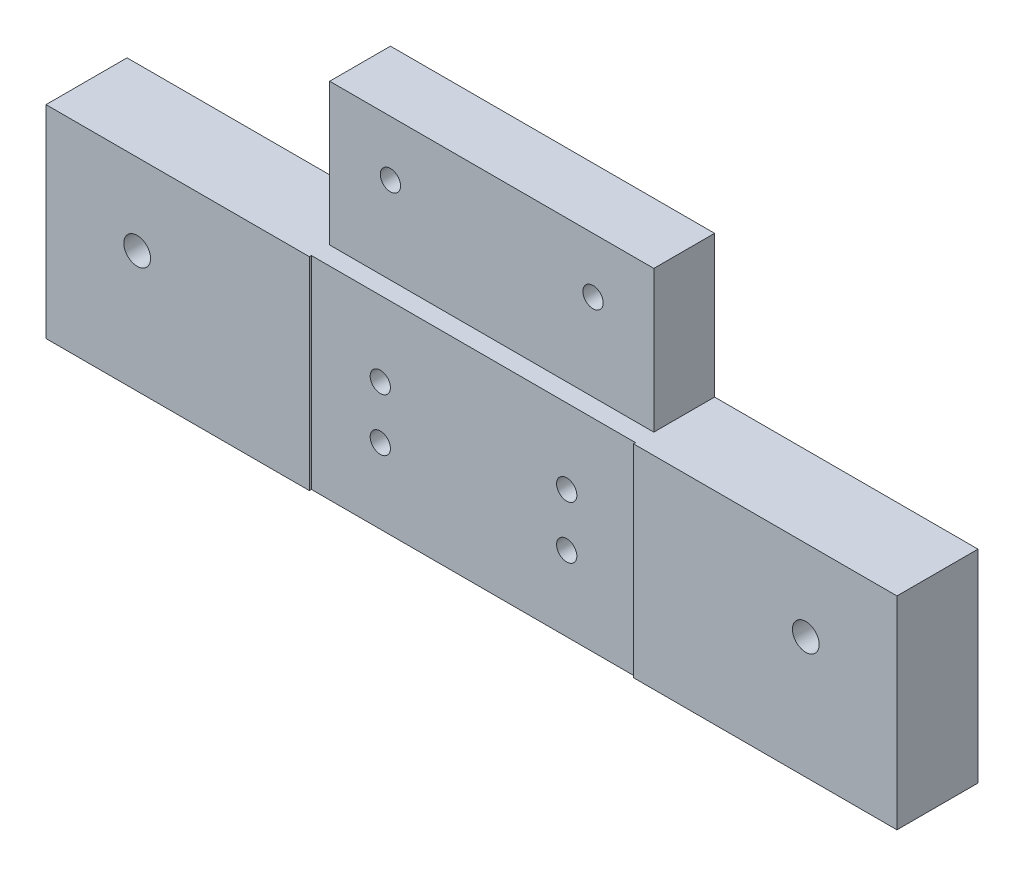
ISO-10303-21;
HEADER;
FILE_DESCRIPTION(('STEP AP214'),'2;1');
FILE_NAME('part.step','',(''),(''),'','','');
FILE_SCHEMA(('AUTOMOTIVE_DESIGN { 1 0 10303 214 1 1 1 1 }'));
ENDSEC;
DATA;
#1=APPLICATION_CONTEXT('core data for automotive mechanical design processes');
#2=APPLICATION_PROTOCOL_DEFINITION('international standard','automotive_design',2000,#1);
#3=PRODUCT_CONTEXT('',#1,'mechanical');
#4=PRODUCT('Part','Part','',(#3));
#5=PRODUCT_RELATED_PRODUCT_CATEGORY('part','',(#4));
#6=PRODUCT_DEFINITION_FORMATION('','',#4);
#7=PRODUCT_DEFINITION_CONTEXT('part definition',#1,'design');
#8=PRODUCT_DEFINITION('design','',#6,#7);
#9=PRODUCT_DEFINITION_SHAPE('','',#8);
#10=(LENGTH_UNIT() NAMED_UNIT(*) SI_UNIT(.MILLI.,.METRE.));
#11=(NAMED_UNIT(*) PLANE_ANGLE_UNIT() SI_UNIT($,.RADIAN.));
#12=(NAMED_UNIT(*) SI_UNIT($,.STERADIAN.) SOLID_ANGLE_UNIT());
#13=UNCERTAINTY_MEASURE_WITH_UNIT(LENGTH_MEASURE(1.E-05),#10,'distance_accuracy_value','');
#14=(GEOMETRIC_REPRESENTATION_CONTEXT(3) GLOBAL_UNCERTAINTY_ASSIGNED_CONTEXT((#13)) GLOBAL_UNIT_ASSIGNED_CONTEXT((#10,
#11,#12)) REPRESENTATION_CONTEXT('',''));
#15=CARTESIAN_POINT('',(0.,0.,0.));
#16=DIRECTION('',(0.,0.,1.));
#17=DIRECTION('',(1.,0.,0.));
#18=AXIS2_PLACEMENT_3D('',#15,#16,#17);
#19=CARTESIAN_POINT('',(0.,0.,20.));
#20=DIRECTION('',(0.,0.,1.));
#21=DIRECTION('',(1.,0.,0.));
#22=AXIS2_PLACEMENT_3D('',#19,#20,#21);
#23=PLANE('',#22);
#24=DIRECTION('',(0.,1.,0.));
#25=VECTOR('',#24,1.);
#26=CARTESIAN_POINT('',(-40.,-25.001,20.));
#27=LINE('',#26,#25);
#28=CARTESIAN_POINT('',(-40.,-25.,20.));
#29=VERTEX_POINT('',#28);
#30=CARTESIAN_POINT('',(-40.,25.,20.));
#31=VERTEX_POINT('',#30);
#32=EDGE_CURVE('E197',#29,#31,#27,.T.);
#33=ORIENTED_EDGE('',*,*,#32,.T.);
#34=DIRECTION('',(-1.,0.,0.));
#35=VECTOR('',#34,1.);
#36=CARTESIAN_POINT('',(-105.,25.,20.));
#37=LINE('',#36,#35);
#38=CARTESIAN_POINT('',(-105.,25.,20.));
#39=VERTEX_POINT('',#38);
#40=EDGE_CURVE('E236',#31,#39,#37,.T.);
#41=ORIENTED_EDGE('',*,*,#40,.T.);
#42=DIRECTION('',(0.,-1.,0.));
#43=VECTOR('',#42,1.);
#44=CARTESIAN_POINT('',(-105.,25.,20.));
#45=LINE('',#44,#43);
#46=CARTESIAN_POINT('',(-105.,-25.,20.));
#47=VERTEX_POINT('',#46);
#48=EDGE_CURVE('E241',#39,#47,#45,.T.);
#49=ORIENTED_EDGE('',*,*,#48,.T.);
#50=DIRECTION('',(1.,0.,0.));
#51=VECTOR('',#50,1.);
#52=CARTESIAN_POINT('',(-105.,-25.,20.));
#53=LINE('',#52,#51);
#54=EDGE_CURVE('E244',#47,#29,#53,.T.);
#55=ORIENTED_EDGE('',*,*,#54,.T.);
#56=EDGE_LOOP('',(#33,#41,#49,#55));
#57=FACE_BOUND('',#56,.T.);
#58=CARTESIAN_POINT('',(-82.5,4.99999999999999,20.));
#59=DIRECTION('',(0.,0.,-1.));
#60=DIRECTION('',(-1.,0.,0.));
#61=AXIS2_PLACEMENT_3D('',#58,#59,#60);
#62=CIRCLE('',#61,3.3);
#63=CARTESIAN_POINT('',(-85.8,4.99999999999999,20.));
#64=VERTEX_POINT('',#63);
#65=EDGE_CURVE('E217',#64,#64,#62,.T.);
#66=ORIENTED_EDGE('',*,*,#65,.T.);
#67=EDGE_LOOP('',(#66));
#68=FACE_BOUND('',#67,.T.);
#69=ADVANCED_FACE('F38',(#57,#68),#23,.T.);
#70=CARTESIAN_POINT('',(105.,25.,20.));
#71=DIRECTION('',(-1.,0.,0.));
#72=DIRECTION('',(0.,-1.,0.));
#73=AXIS2_PLACEMENT_3D('',#70,#71,#72);
#74=PLANE('',#73);
#75=DIRECTION('',(0.,1.,0.));
#76=VECTOR('',#75,1.);
#77=CARTESIAN_POINT('',(105.,25.,0.));
#78=LINE('',#77,#76);
#79=CARTESIAN_POINT('',(105.,-25.,0.));
#80=VERTEX_POINT('',#79);
#81=CARTESIAN_POINT('',(105.,25.,0.));
#82=VERTEX_POINT('',#81);
#83=EDGE_CURVE('E232',#80,#82,#78,.T.);
#84=ORIENTED_EDGE('',*,*,#83,.T.);
#85=DIRECTION('',(0.,0.,-1.));
#86=VECTOR('',#85,1.);
#87=CARTESIAN_POINT('',(105.,25.,20.));
#88=LINE('',#87,#86);
#89=CARTESIAN_POINT('',(105.,25.,20.));
#90=VERTEX_POINT('',#89);
#91=EDGE_CURVE('E11',#90,#82,#88,.T.);
#92=ORIENTED_EDGE('',*,*,#91,.F.);
#93=DIRECTION('',(0.,1.,0.));
#94=VECTOR('',#93,1.);
#95=CARTESIAN_POINT('',(105.,25.,20.));
#96=LINE('',#95,#94);
#97=CARTESIAN_POINT('',(105.,-25.,20.));
#98=VERTEX_POINT('',#97);
#99=EDGE_CURVE('E233',#98,#90,#96,.T.);
#100=ORIENTED_EDGE('',*,*,#99,.F.);
#101=DIRECTION('',(0.,0.,-1.));
#102=VECTOR('',#101,1.);
#103=CARTESIAN_POINT('',(105.,-25.,20.));
#104=LINE('',#103,#102);
#105=EDGE_CURVE('E247',#98,#80,#104,.T.);
#106=ORIENTED_EDGE('',*,*,#105,.T.);
#107=EDGE_LOOP('',(#84,#92,#100,#106));
#108=FACE_BOUND('',#107,.T.);
#109=ADVANCED_FACE('F40',(#108),#74,.F.);
#110=CARTESIAN_POINT('',(-105.,25.,20.));
#111=DIRECTION('',(0.,-1.,0.));
#112=DIRECTION('',(0.,0.,-1.));
#113=AXIS2_PLACEMENT_3D('',#110,#111,#112);
#114=PLANE('',#113);
#115=DIRECTION('',(-1.,0.,0.));
#116=VECTOR('',#115,1.);
#117=CARTESIAN_POINT('',(-105.,25.,0.));
#118=LINE('',#117,#116);
#119=CARTESIAN_POINT('',(40.,25.,0.));
#120=VERTEX_POINT('',#119);
#121=EDGE_CURVE('E251',#82,#120,#118,.T.);
#122=ORIENTED_EDGE('',*,*,#121,.T.);
#123=DIRECTION('',(0.,0.,1.));
#124=VECTOR('',#123,1.);
#125=CARTESIAN_POINT('',(40.,25.,-87.3212459828649));
#126=LINE('',#125,#124);
#127=CARTESIAN_POINT('',(40.,25.,15.));
#128=VERTEX_POINT('',#127);
#129=EDGE_CURVE('E151',#120,#128,#126,.T.);
#130=ORIENTED_EDGE('',*,*,#129,.T.);
#131=DIRECTION('',(-1.,0.,0.));
#132=VECTOR('',#131,1.);
#133=CARTESIAN_POINT('',(-40.,25.,15.));
#134=LINE('',#133,#132);
#135=CARTESIAN_POINT('',(-40.,25.,15.));
#136=VERTEX_POINT('',#135);
#137=EDGE_CURVE('E53',#128,#136,#134,.T.);
#138=ORIENTED_EDGE('',*,*,#137,.T.);
#139=DIRECTION('',(0.,0.,1.));
#140=VECTOR('',#139,1.);
#141=CARTESIAN_POINT('',(-40.,25.,-87.3212459828649));
#142=LINE('',#141,#140);
#143=CARTESIAN_POINT('',(-40.,25.,0.));
#144=VERTEX_POINT('',#143);
#145=EDGE_CURVE('E60',#144,#136,#142,.T.);
#146=ORIENTED_EDGE('',*,*,#145,.F.);
#147=CARTESIAN_POINT('',(-105.,25.,0.));
#148=VERTEX_POINT('',#147);
#149=EDGE_CURVE('E250',#144,#148,#118,.T.);
#150=ORIENTED_EDGE('',*,*,#149,.T.);
#151=DIRECTION('',(0.,0.,-1.));
#152=VECTOR('',#151,1.);
#153=CARTESIAN_POINT('',(-105.,25.,20.));
#154=LINE('',#153,#152);
#155=EDGE_CURVE('E46',#39,#148,#154,.T.);
#156=ORIENTED_EDGE('',*,*,#155,.F.);
#157=ORIENTED_EDGE('',*,*,#40,.F.);
#158=DIRECTION('',(0.,0.,1.));
#159=VECTOR('',#158,1.);
#160=CARTESIAN_POINT('',(-40.,25.,19.5));
#161=LINE('',#160,#159);
#162=CARTESIAN_POINT('',(-40.,25.,19.5));
#163=VERTEX_POINT('',#162);
#164=EDGE_CURVE('E192',#163,#31,#161,.T.);
#165=ORIENTED_EDGE('',*,*,#164,.F.);
#166=DIRECTION('',(-1.,0.,0.));
#167=VECTOR('',#166,1.);
#168=CARTESIAN_POINT('',(-40.,25.,19.5));
#169=LINE('',#168,#167);
#170=CARTESIAN_POINT('',(40.,25.,19.5));
#171=VERTEX_POINT('',#170);
#172=EDGE_CURVE('E141',#171,#163,#169,.T.);
#173=ORIENTED_EDGE('',*,*,#172,.F.);
#174=DIRECTION('',(0.,0.,-1.));
#175=VECTOR('',#174,1.);
#176=CARTESIAN_POINT('',(40.,25.,19.5));
#177=LINE('',#176,#175);
#178=CARTESIAN_POINT('',(40.,25.,20.));
#179=VERTEX_POINT('',#178);
#180=EDGE_CURVE('E194',#179,#171,#177,.T.);
#181=ORIENTED_EDGE('',*,*,#180,.F.);
#182=EDGE_CURVE('E238',#90,#179,#37,.T.);
#183=ORIENTED_EDGE('',*,*,#182,.F.);
#184=ORIENTED_EDGE('',*,*,#91,.T.);
#185=EDGE_LOOP('',(#122,#130,#138,#146,#150,#156,#157,#165,#173,#181,#183,#184));
#186=FACE_BOUND('',#185,.T.);
#187=ADVANCED_FACE('F297',(#186),#114,.F.);
#188=CARTESIAN_POINT('',(-105.,25.,20.));
#189=DIRECTION('',(1.,0.,0.));
#190=DIRECTION('',(0.,1.,0.));
#191=AXIS2_PLACEMENT_3D('',#188,#189,#190);
#192=PLANE('',#191);
#193=DIRECTION('',(0.,-1.,0.));
#194=VECTOR('',#193,1.);
#195=CARTESIAN_POINT('',(-105.,25.,0.));
#196=LINE('',#195,#194);
#197=CARTESIAN_POINT('',(-105.,-25.,0.));
#198=VERTEX_POINT('',#197);
#199=EDGE_CURVE('E253',#148,#198,#196,.T.);
#200=ORIENTED_EDGE('',*,*,#199,.T.);
#201=DIRECTION('',(0.,0.,-1.));
#202=VECTOR('',#201,1.);
#203=CARTESIAN_POINT('',(-105.,-25.,20.));
#204=LINE('',#203,#202);
#205=EDGE_CURVE('E258',#47,#198,#204,.T.);
#206=ORIENTED_EDGE('',*,*,#205,.F.);
#207=ORIENTED_EDGE('',*,*,#48,.F.);
#208=ORIENTED_EDGE('',*,*,#155,.T.);
#209=EDGE_LOOP('',(#200,#206,#207,#208));
#210=FACE_BOUND('',#209,.T.);
#211=ADVANCED_FACE('F265',(#210),#192,.F.);
#212=CARTESIAN_POINT('',(-105.,-25.,20.));
#213=DIRECTION('',(0.,1.,0.));
#214=DIRECTION('',(-1.,0.,0.));
#215=AXIS2_PLACEMENT_3D('',#212,#213,#214);
#216=PLANE('',#215);
#217=DIRECTION('',(1.,0.,0.));
#218=VECTOR('',#217,1.);
#219=CARTESIAN_POINT('',(-40.,-25.,19.5));
#220=LINE('',#219,#218);
#221=CARTESIAN_POINT('',(-40.,-25.,19.5));
#222=VERTEX_POINT('',#221);
#223=CARTESIAN_POINT('',(40.,-25.,19.5));
#224=VERTEX_POINT('',#223);
#225=EDGE_CURVE('E186',#222,#224,#220,.T.);
#226=ORIENTED_EDGE('',*,*,#225,.F.);
#227=DIRECTION('',(0.,0.,-1.));
#228=VECTOR('',#227,1.);
#229=CARTESIAN_POINT('',(-40.,-25.,19.5));
#230=LINE('',#229,#228);
#231=EDGE_CURVE('E189',#29,#222,#230,.T.);
#232=ORIENTED_EDGE('',*,*,#231,.F.);
#233=ORIENTED_EDGE('',*,*,#54,.F.);
#234=ORIENTED_EDGE('',*,*,#205,.T.);
#235=DIRECTION('',(1.,0.,0.));
#236=VECTOR('',#235,1.);
#237=CARTESIAN_POINT('',(-105.,-25.,0.));
#238=LINE('',#237,#236);
#239=EDGE_CURVE('E237',#198,#80,#238,.T.);
#240=ORIENTED_EDGE('',*,*,#239,.T.);
#241=ORIENTED_EDGE('',*,*,#105,.F.);
#242=CARTESIAN_POINT('',(40.,-25.,20.));
#243=VERTEX_POINT('',#242);
#244=EDGE_CURVE('E243',#243,#98,#53,.T.);
#245=ORIENTED_EDGE('',*,*,#244,.F.);
#246=DIRECTION('',(0.,0.,1.));
#247=VECTOR('',#246,1.);
#248=CARTESIAN_POINT('',(40.,-25.,19.5));
#249=LINE('',#248,#247);
#250=EDGE_CURVE('E184',#224,#243,#249,.T.);
#251=ORIENTED_EDGE('',*,*,#250,.F.);
#252=EDGE_LOOP('',(#226,#232,#233,#234,#240,#241,#245,#251));
#253=FACE_BOUND('',#252,.T.);
#254=ADVANCED_FACE('F275',(#253),#216,.F.);
#255=DIRECTION('',(0.,1.,0.));
#256=VECTOR('',#255,1.);
#257=CARTESIAN_POINT('',(40.,-25.001,20.));
#258=LINE('',#257,#256);
#259=EDGE_CURVE('E205',#243,#179,#258,.T.);
#260=ORIENTED_EDGE('',*,*,#259,.F.);
#261=ORIENTED_EDGE('',*,*,#244,.T.);
#262=ORIENTED_EDGE('',*,*,#99,.T.);
#263=ORIENTED_EDGE('',*,*,#182,.T.);
#264=EDGE_LOOP('',(#260,#261,#262,#263));
#265=FACE_BOUND('',#264,.T.);
#266=CARTESIAN_POINT('',(82.5,5.00000000000001,20.));
#267=DIRECTION('',(0.,0.,-1.));
#268=DIRECTION('',(-1.,0.,0.));
#269=AXIS2_PLACEMENT_3D('',#266,#267,#268);
#270=CIRCLE('',#269,3.3);
#271=CARTESIAN_POINT('',(79.2,5.00000000000001,20.));
#272=VERTEX_POINT('',#271);
#273=EDGE_CURVE('E229',#272,#272,#270,.T.);
#274=ORIENTED_EDGE('',*,*,#273,.T.);
#275=EDGE_LOOP('',(#274));
#276=FACE_BOUND('',#275,.T.);
#277=ADVANCED_FACE('F283',(#265,#276),#23,.T.);
#278=CARTESIAN_POINT('',(0.,0.,0.));
#279=DIRECTION('',(0.,0.,1.));
#280=DIRECTION('',(1.,0.,0.));
#281=AXIS2_PLACEMENT_3D('',#278,#279,#280);
#282=PLANE('',#281);
#283=CARTESIAN_POINT('',(-25.0000000000047,46.3594100266106,0.));
#284=DIRECTION('',(0.,0.,1.));
#285=DIRECTION('',(1.,0.,0.));
#286=AXIS2_PLACEMENT_3D('',#283,#284,#285);
#287=CIRCLE('',#286,2.5);
#288=CARTESIAN_POINT('',(-22.5000000000047,46.3594100266106,0.));
#289=VERTEX_POINT('',#288);
#290=EDGE_CURVE('E311',#289,#289,#287,.T.);
#291=ORIENTED_EDGE('',*,*,#290,.T.);
#292=EDGE_LOOP('',(#291));
#293=FACE_BOUND('',#292,.T.);
#294=CARTESIAN_POINT('',(24.9999999999954,46.3594100266106,0.));
#295=DIRECTION('',(0.,0.,1.));
#296=DIRECTION('',(1.,0.,0.));
#297=AXIS2_PLACEMENT_3D('',#294,#295,#296);
#298=CIRCLE('',#297,2.5);
#299=CARTESIAN_POINT('',(27.4999999999954,46.3594100266106,0.));
#300=VERTEX_POINT('',#299);
#301=EDGE_CURVE('E134',#300,#300,#298,.T.);
#302=ORIENTED_EDGE('',*,*,#301,.T.);
#303=EDGE_LOOP('',(#302));
#304=FACE_BOUND('',#303,.T.);
#305=CARTESIAN_POINT('',(-23.,6.49999999999645,0.));
#306=DIRECTION('',(0.,0.,1.));
#307=DIRECTION('',(1.,0.,0.));
#308=AXIS2_PLACEMENT_3D('',#305,#306,#307);
#309=CIRCLE('',#308,2.5);
#310=CARTESIAN_POINT('',(-20.5,6.49999999999645,0.));
#311=VERTEX_POINT('',#310);
#312=EDGE_CURVE('E163',#311,#311,#309,.T.);
#313=ORIENTED_EDGE('',*,*,#312,.T.);
#314=EDGE_LOOP('',(#313));
#315=FACE_BOUND('',#314,.T.);
#316=CARTESIAN_POINT('',(-23.,-6.50000000000356,0.));
#317=DIRECTION('',(0.,0.,1.));
#318=DIRECTION('',(1.,0.,0.));
#319=AXIS2_PLACEMENT_3D('',#316,#317,#318);
#320=CIRCLE('',#319,2.5);
#321=CARTESIAN_POINT('',(-20.5,-6.50000000000356,0.));
#322=VERTEX_POINT('',#321);
#323=EDGE_CURVE('E169',#322,#322,#320,.T.);
#324=ORIENTED_EDGE('',*,*,#323,.T.);
#325=EDGE_LOOP('',(#324));
#326=FACE_BOUND('',#325,.T.);
#327=CARTESIAN_POINT('',(23.,6.49999999999645,0.));
#328=DIRECTION('',(0.,0.,1.));
#329=DIRECTION('',(1.,0.,0.));
#330=AXIS2_PLACEMENT_3D('',#327,#328,#329);
#331=CIRCLE('',#330,2.5);
#332=CARTESIAN_POINT('',(25.5,6.49999999999645,0.));
#333=VERTEX_POINT('',#332);
#334=EDGE_CURVE('E175',#333,#333,#331,.T.);
#335=ORIENTED_EDGE('',*,*,#334,.T.);
#336=EDGE_LOOP('',(#335));
#337=FACE_BOUND('',#336,.T.);
#338=CARTESIAN_POINT('',(23.,-6.50000000000356,0.));
#339=DIRECTION('',(0.,0.,1.));
#340=DIRECTION('',(1.,0.,0.));
#341=AXIS2_PLACEMENT_3D('',#338,#339,#340);
#342=CIRCLE('',#341,2.5);
#343=CARTESIAN_POINT('',(25.5,-6.50000000000356,0.));
#344=VERTEX_POINT('',#343);
#345=EDGE_CURVE('E181',#344,#344,#342,.T.);
#346=ORIENTED_EDGE('',*,*,#345,.T.);
#347=EDGE_LOOP('',(#346));
#348=FACE_BOUND('',#347,.T.);
#349=CARTESIAN_POINT('',(-82.5,4.99999999999999,0.));
#350=DIRECTION('',(0.,0.,-1.));
#351=DIRECTION('',(-1.,0.,0.));
#352=AXIS2_PLACEMENT_3D('',#349,#350,#351);
#353=CIRCLE('',#352,7.99999999999999);
#354=CARTESIAN_POINT('',(-90.5,4.99999999999999,0.));
#355=VERTEX_POINT('',#354);
#356=EDGE_CURVE('E201',#355,#355,#353,.T.);
#357=ORIENTED_EDGE('',*,*,#356,.F.);
#358=EDGE_LOOP('',(#357));
#359=FACE_BOUND('',#358,.T.);
#360=CARTESIAN_POINT('',(82.5,5.00000000000001,0.));
#361=DIRECTION('',(0.,0.,-1.));
#362=DIRECTION('',(-1.,0.,0.));
#363=AXIS2_PLACEMENT_3D('',#360,#361,#362);
#364=CIRCLE('',#363,7.99999999999999);
#365=CARTESIAN_POINT('',(74.5,5.00000000000001,0.));
#366=VERTEX_POINT('',#365);
#367=EDGE_CURVE('E220',#366,#366,#364,.T.);
#368=ORIENTED_EDGE('',*,*,#367,.F.);
#369=EDGE_LOOP('',(#368));
#370=FACE_BOUND('',#369,.T.);
#371=ORIENTED_EDGE('',*,*,#83,.F.);
#372=ORIENTED_EDGE('',*,*,#239,.F.);
#373=ORIENTED_EDGE('',*,*,#199,.F.);
#374=ORIENTED_EDGE('',*,*,#149,.F.);
#375=DIRECTION('',(0.,1.,0.));
#376=VECTOR('',#375,1.);
#377=CARTESIAN_POINT('',(-40.,25.,0.));
#378=LINE('',#377,#376);
#379=CARTESIAN_POINT('',(-40.,60.,0.));
#380=VERTEX_POINT('',#379);
#381=EDGE_CURVE('E154',#144,#380,#378,.T.);
#382=ORIENTED_EDGE('',*,*,#381,.T.);
#383=DIRECTION('',(1.,0.,0.));
#384=VECTOR('',#383,1.);
#385=CARTESIAN_POINT('',(-40.,60.,0.));
#386=LINE('',#385,#384);
#387=CARTESIAN_POINT('',(40.,60.,0.));
#388=VERTEX_POINT('',#387);
#389=EDGE_CURVE('E145',#380,#388,#386,.T.);
#390=ORIENTED_EDGE('',*,*,#389,.T.);
#391=DIRECTION('',(0.,-1.,0.));
#392=VECTOR('',#391,1.);
#393=CARTESIAN_POINT('',(40.,25.,0.));
#394=LINE('',#393,#392);
#395=EDGE_CURVE('E146',#388,#120,#394,.T.);
#396=ORIENTED_EDGE('',*,*,#395,.T.);
#397=ORIENTED_EDGE('',*,*,#121,.F.);
#398=EDGE_LOOP('',(#371,#372,#373,#374,#382,#390,#396,#397));
#399=FACE_BOUND('',#398,.T.);
#400=ADVANCED_FACE('F271',(#293,#304,#315,#326,#337,#348,#359,#370,#399),#282,.F.);
#401=CARTESIAN_POINT('',(82.5,5.00000000000001,0.));
#402=DIRECTION('',(0.,0.,-1.));
#403=DIRECTION('',(-1.,0.,0.));
#404=AXIS2_PLACEMENT_3D('',#401,#402,#403);
#405=CYLINDRICAL_SURFACE('',#404,3.3);
#406=ORIENTED_EDGE('',*,*,#273,.F.);
#407=EDGE_LOOP('',(#406));
#408=FACE_BOUND('',#407,.T.);
#409=CARTESIAN_POINT('',(82.5,5.00000000000001,6.6));
#410=DIRECTION('',(0.,0.,-1.));
#411=DIRECTION('',(-1.,0.,0.));
#412=AXIS2_PLACEMENT_3D('',#409,#410,#411);
#413=CIRCLE('',#412,3.3);
#414=CARTESIAN_POINT('',(79.2,5.00000000000001,6.6));
#415=VERTEX_POINT('',#414);
#416=EDGE_CURVE('E226',#415,#415,#413,.T.);
#417=ORIENTED_EDGE('',*,*,#416,.T.);
#418=EDGE_LOOP('',(#417));
#419=FACE_BOUND('',#418,.T.);
#420=ADVANCED_FACE('F347',(#408,#419),#405,.F.);
#421=CARTESIAN_POINT('',(85.8,5.00000000000001,6.6));
#422=DIRECTION('',(0.,0.,1.));
#423=DIRECTION('',(1.,0.,0.));
#424=AXIS2_PLACEMENT_3D('',#421,#422,#423);
#425=PLANE('',#424);
#426=ORIENTED_EDGE('',*,*,#416,.F.);
#427=EDGE_LOOP('',(#426));
#428=FACE_BOUND('',#427,.T.);
#429=CARTESIAN_POINT('',(82.5,5.00000000000001,6.6));
#430=DIRECTION('',(0.,0.,-1.));
#431=DIRECTION('',(-1.,0.,0.));
#432=AXIS2_PLACEMENT_3D('',#429,#430,#431);
#433=CIRCLE('',#432,7.99999999999999);
#434=CARTESIAN_POINT('',(74.5,5.00000000000001,6.6));
#435=VERTEX_POINT('',#434);
#436=EDGE_CURVE('E223',#435,#435,#433,.T.);
#437=ORIENTED_EDGE('',*,*,#436,.T.);
#438=EDGE_LOOP('',(#437));
#439=FACE_BOUND('',#438,.T.);
#440=ADVANCED_FACE('F378',(#428,#439),#425,.F.);
#441=CARTESIAN_POINT('',(82.5,5.00000000000001,0.));
#442=DIRECTION('',(0.,0.,-1.));
#443=DIRECTION('',(-1.,0.,0.));
#444=AXIS2_PLACEMENT_3D('',#441,#442,#443);
#445=CYLINDRICAL_SURFACE('',#444,7.99999999999999);
#446=ORIENTED_EDGE('',*,*,#436,.F.);
#447=EDGE_LOOP('',(#446));
#448=FACE_BOUND('',#447,.T.);
#449=ORIENTED_EDGE('',*,*,#367,.T.);
#450=EDGE_LOOP('',(#449));
#451=FACE_BOUND('',#450,.T.);
#452=ADVANCED_FACE('F388',(#448,#451),#445,.F.);
#453=CARTESIAN_POINT('',(-82.5,4.99999999999999,0.));
#454=DIRECTION('',(0.,0.,-1.));
#455=DIRECTION('',(-1.,0.,0.));
#456=AXIS2_PLACEMENT_3D('',#453,#454,#455);
#457=CYLINDRICAL_SURFACE('',#456,3.3);
#458=ORIENTED_EDGE('',*,*,#65,.F.);
#459=EDGE_LOOP('',(#458));
#460=FACE_BOUND('',#459,.T.);
#461=CARTESIAN_POINT('',(-82.5,4.99999999999999,6.6));
#462=DIRECTION('',(0.,0.,-1.));
#463=DIRECTION('',(-1.,0.,0.));
#464=AXIS2_PLACEMENT_3D('',#461,#462,#463);
#465=CIRCLE('',#464,3.3);
#466=CARTESIAN_POINT('',(-85.8,4.99999999999999,6.6));
#467=VERTEX_POINT('',#466);
#468=EDGE_CURVE('E214',#467,#467,#465,.T.);
#469=ORIENTED_EDGE('',*,*,#468,.T.);
#470=EDGE_LOOP('',(#469));
#471=FACE_BOUND('',#470,.T.);
#472=ADVANCED_FACE('F398',(#460,#471),#457,.F.);
#473=CARTESIAN_POINT('',(-79.2,4.99999999999999,6.6));
#474=DIRECTION('',(0.,0.,1.));
#475=DIRECTION('',(1.,0.,0.));
#476=AXIS2_PLACEMENT_3D('',#473,#474,#475);
#477=PLANE('',#476);
#478=ORIENTED_EDGE('',*,*,#468,.F.);
#479=EDGE_LOOP('',(#478));
#480=FACE_BOUND('',#479,.T.);
#481=CARTESIAN_POINT('',(-82.5,4.99999999999999,6.6));
#482=DIRECTION('',(0.,0.,-1.));
#483=DIRECTION('',(-1.,0.,0.));
#484=AXIS2_PLACEMENT_3D('',#481,#482,#483);
#485=CIRCLE('',#484,7.99999999999999);
#486=CARTESIAN_POINT('',(-90.5,4.99999999999999,6.6));
#487=VERTEX_POINT('',#486);
#488=EDGE_CURVE('E211',#487,#487,#485,.T.);
#489=ORIENTED_EDGE('',*,*,#488,.T.);
#490=EDGE_LOOP('',(#489));
#491=FACE_BOUND('',#490,.T.);
#492=ADVANCED_FACE('F408',(#480,#491),#477,.F.);
#493=CARTESIAN_POINT('',(-82.5,4.99999999999999,0.));
#494=DIRECTION('',(0.,0.,-1.));
#495=DIRECTION('',(-1.,0.,0.));
#496=AXIS2_PLACEMENT_3D('',#493,#494,#495);
#497=CYLINDRICAL_SURFACE('',#496,7.99999999999999);
#498=ORIENTED_EDGE('',*,*,#488,.F.);
#499=EDGE_LOOP('',(#498));
#500=FACE_BOUND('',#499,.T.);
#501=ORIENTED_EDGE('',*,*,#356,.T.);
#502=EDGE_LOOP('',(#501));
#503=FACE_BOUND('',#502,.T.);
#504=ADVANCED_FACE('F418',(#500,#503),#497,.F.);
#505=CARTESIAN_POINT('',(-40.,-25.001,19.5));
#506=DIRECTION('',(-1.,0.,0.));
#507=DIRECTION('',(0.,0.,1.));
#508=AXIS2_PLACEMENT_3D('',#505,#506,#507);
#509=PLANE('',#508);
#510=ORIENTED_EDGE('',*,*,#231,.T.);
#511=DIRECTION('',(0.,1.,0.));
#512=VECTOR('',#511,1.);
#513=CARTESIAN_POINT('',(-40.,-25.001,19.5));
#514=LINE('',#513,#512);
#515=EDGE_CURVE('E198',#222,#163,#514,.T.);
#516=ORIENTED_EDGE('',*,*,#515,.T.);
#517=ORIENTED_EDGE('',*,*,#164,.T.);
#518=ORIENTED_EDGE('',*,*,#32,.F.);
#519=EDGE_LOOP('',(#510,#516,#517,#518));
#520=FACE_BOUND('',#519,.T.);
#521=ADVANCED_FACE('F294',(#520),#509,.F.);
#522=CARTESIAN_POINT('',(-40.,-25.001,19.5));
#523=DIRECTION('',(0.,0.,-1.));
#524=DIRECTION('',(-1.,0.,0.));
#525=AXIS2_PLACEMENT_3D('',#522,#523,#524);
#526=PLANE('',#525);
#527=CARTESIAN_POINT('',(-23.,6.49999999999645,19.5));
#528=DIRECTION('',(0.,0.,1.));
#529=DIRECTION('',(1.,0.,0.));
#530=AXIS2_PLACEMENT_3D('',#527,#528,#529);
#531=CIRCLE('',#530,2.49999999999999);
#532=CARTESIAN_POINT('',(-20.5,6.49999999999645,19.5));
#533=VERTEX_POINT('',#532);
#534=EDGE_CURVE('E160',#533,#533,#531,.T.);
#535=ORIENTED_EDGE('',*,*,#534,.F.);
#536=EDGE_LOOP('',(#535));
#537=FACE_BOUND('',#536,.T.);
#538=CARTESIAN_POINT('',(-23.,-6.50000000000356,19.5));
#539=DIRECTION('',(0.,0.,1.));
#540=DIRECTION('',(1.,0.,0.));
#541=AXIS2_PLACEMENT_3D('',#538,#539,#540);
#542=CIRCLE('',#541,2.49999999999999);
#543=CARTESIAN_POINT('',(-20.5,-6.50000000000356,19.5));
#544=VERTEX_POINT('',#543);
#545=EDGE_CURVE('E166',#544,#544,#542,.T.);
#546=ORIENTED_EDGE('',*,*,#545,.F.);
#547=EDGE_LOOP('',(#546));
#548=FACE_BOUND('',#547,.T.);
#549=CARTESIAN_POINT('',(23.,6.49999999999645,19.5));
#550=DIRECTION('',(0.,0.,1.));
#551=DIRECTION('',(1.,0.,0.));
#552=AXIS2_PLACEMENT_3D('',#549,#550,#551);
#553=CIRCLE('',#552,2.49999999999999);
#554=CARTESIAN_POINT('',(25.5,6.49999999999645,19.5));
#555=VERTEX_POINT('',#554);
#556=EDGE_CURVE('E172',#555,#555,#553,.T.);
#557=ORIENTED_EDGE('',*,*,#556,.F.);
#558=EDGE_LOOP('',(#557));
#559=FACE_BOUND('',#558,.T.);
#560=CARTESIAN_POINT('',(23.,-6.50000000000356,19.5));
#561=DIRECTION('',(0.,0.,1.));
#562=DIRECTION('',(1.,0.,0.));
#563=AXIS2_PLACEMENT_3D('',#560,#561,#562);
#564=CIRCLE('',#563,2.49999999999999);
#565=CARTESIAN_POINT('',(25.5,-6.50000000000356,19.5));
#566=VERTEX_POINT('',#565);
#567=EDGE_CURVE('E178',#566,#566,#564,.T.);
#568=ORIENTED_EDGE('',*,*,#567,.F.);
#569=EDGE_LOOP('',(#568));
#570=FACE_BOUND('',#569,.T.);
#571=DIRECTION('',(0.,1.,0.));
#572=VECTOR('',#571,1.);
#573=CARTESIAN_POINT('',(40.,-25.001,19.5));
#574=LINE('',#573,#572);
#575=EDGE_CURVE('E202',#224,#171,#574,.T.);
#576=ORIENTED_EDGE('',*,*,#575,.T.);
#577=ORIENTED_EDGE('',*,*,#172,.T.);
#578=ORIENTED_EDGE('',*,*,#515,.F.);
#579=ORIENTED_EDGE('',*,*,#225,.T.);
#580=EDGE_LOOP('',(#576,#577,#578,#579));
#581=FACE_BOUND('',#580,.T.);
#582=ADVANCED_FACE('F291',(#537,#548,#559,#570,#581),#526,.F.);
#583=CARTESIAN_POINT('',(40.,-25.001,19.5));
#584=DIRECTION('',(1.,0.,0.));
#585=DIRECTION('',(0.,0.,-1.));
#586=AXIS2_PLACEMENT_3D('',#583,#584,#585);
#587=PLANE('',#586);
#588=ORIENTED_EDGE('',*,*,#250,.T.);
#589=ORIENTED_EDGE('',*,*,#259,.T.);
#590=ORIENTED_EDGE('',*,*,#180,.T.);
#591=ORIENTED_EDGE('',*,*,#575,.F.);
#592=EDGE_LOOP('',(#588,#589,#590,#591));
#593=FACE_BOUND('',#592,.T.);
#594=ADVANCED_FACE('F288',(#593),#587,.F.);
#595=CARTESIAN_POINT('',(23.,-6.50000000000356,19.5));
#596=DIRECTION('',(0.,0.,1.));
#597=DIRECTION('',(1.,0.,0.));
#598=AXIS2_PLACEMENT_3D('',#595,#596,#597);
#599=CYLINDRICAL_SURFACE('',#598,2.49999999999999);
#600=ORIENTED_EDGE('',*,*,#345,.F.);
#601=EDGE_LOOP('',(#600));
#602=FACE_BOUND('',#601,.T.);
#603=ORIENTED_EDGE('',*,*,#567,.T.);
#604=EDGE_LOOP('',(#603));
#605=FACE_BOUND('',#604,.T.);
#606=ADVANCED_FACE('F446',(#602,#605),#599,.F.);
#607=CARTESIAN_POINT('',(23.,6.49999999999645,19.5));
#608=DIRECTION('',(0.,0.,1.));
#609=DIRECTION('',(1.,0.,0.));
#610=AXIS2_PLACEMENT_3D('',#607,#608,#609);
#611=CYLINDRICAL_SURFACE('',#610,2.49999999999999);
#612=ORIENTED_EDGE('',*,*,#334,.F.);
#613=EDGE_LOOP('',(#612));
#614=FACE_BOUND('',#613,.T.);
#615=ORIENTED_EDGE('',*,*,#556,.T.);
#616=EDGE_LOOP('',(#615));
#617=FACE_BOUND('',#616,.T.);
#618=ADVANCED_FACE('F452',(#614,#617),#611,.F.);
#619=CARTESIAN_POINT('',(-23.,-6.50000000000356,19.5));
#620=DIRECTION('',(0.,0.,1.));
#621=DIRECTION('',(1.,0.,0.));
#622=AXIS2_PLACEMENT_3D('',#619,#620,#621);
#623=CYLINDRICAL_SURFACE('',#622,2.49999999999999);
#624=ORIENTED_EDGE('',*,*,#323,.F.);
#625=EDGE_LOOP('',(#624));
#626=FACE_BOUND('',#625,.T.);
#627=ORIENTED_EDGE('',*,*,#545,.T.);
#628=EDGE_LOOP('',(#627));
#629=FACE_BOUND('',#628,.T.);
#630=ADVANCED_FACE('F465',(#626,#629),#623,.F.);
#631=CARTESIAN_POINT('',(-23.,6.49999999999645,19.5));
#632=DIRECTION('',(0.,0.,1.));
#633=DIRECTION('',(1.,0.,0.));
#634=AXIS2_PLACEMENT_3D('',#631,#632,#633);
#635=CYLINDRICAL_SURFACE('',#634,2.49999999999999);
#636=ORIENTED_EDGE('',*,*,#312,.F.);
#637=EDGE_LOOP('',(#636));
#638=FACE_BOUND('',#637,.T.);
#639=ORIENTED_EDGE('',*,*,#534,.T.);
#640=EDGE_LOOP('',(#639));
#641=FACE_BOUND('',#640,.T.);
#642=ADVANCED_FACE('F476',(#638,#641),#635,.F.);
#643=CARTESIAN_POINT('',(-40.,25.,-87.3212459828649));
#644=DIRECTION('',(-1.,0.,0.));
#645=DIRECTION('',(0.,0.,1.));
#646=AXIS2_PLACEMENT_3D('',#643,#644,#645);
#647=PLANE('',#646);
#648=DIRECTION('',(0.,1.,0.));
#649=VECTOR('',#648,1.);
#650=CARTESIAN_POINT('',(-40.,-55.156097709407,15.));
#651=LINE('',#650,#649);
#652=CARTESIAN_POINT('',(-40.,60.,15.));
#653=VERTEX_POINT('',#652);
#654=EDGE_CURVE('E128',#136,#653,#651,.T.);
#655=ORIENTED_EDGE('',*,*,#654,.T.);
#656=DIRECTION('',(0.,0.,1.));
#657=VECTOR('',#656,1.);
#658=CARTESIAN_POINT('',(-40.,60.,-87.3212459828649));
#659=LINE('',#658,#657);
#660=EDGE_CURVE('E140',#380,#653,#659,.T.);
#661=ORIENTED_EDGE('',*,*,#660,.F.);
#662=ORIENTED_EDGE('',*,*,#381,.F.);
#663=ORIENTED_EDGE('',*,*,#145,.T.);
#664=EDGE_LOOP('',(#655,#661,#662,#663));
#665=FACE_BOUND('',#664,.T.);
#666=ADVANCED_FACE('F138',(#665),#647,.T.);
#667=CARTESIAN_POINT('',(-40.,60.,-87.3212459828649));
#668=DIRECTION('',(0.,1.,0.));
#669=DIRECTION('',(0.,0.,1.));
#670=AXIS2_PLACEMENT_3D('',#667,#668,#669);
#671=PLANE('',#670);
#672=DIRECTION('',(-1.,0.,0.));
#673=VECTOR('',#672,1.);
#674=CARTESIAN_POINT('',(-40.,60.,15.));
#675=LINE('',#674,#673);
#676=CARTESIAN_POINT('',(40.,60.,15.));
#677=VERTEX_POINT('',#676);
#678=EDGE_CURVE('E125',#677,#653,#675,.T.);
#679=ORIENTED_EDGE('',*,*,#678,.F.);
#680=DIRECTION('',(0.,0.,1.));
#681=VECTOR('',#680,1.);
#682=CARTESIAN_POINT('',(40.,60.,-87.3212459828649));
#683=LINE('',#682,#681);
#684=EDGE_CURVE('E147',#388,#677,#683,.T.);
#685=ORIENTED_EDGE('',*,*,#684,.F.);
#686=ORIENTED_EDGE('',*,*,#389,.F.);
#687=ORIENTED_EDGE('',*,*,#660,.T.);
#688=EDGE_LOOP('',(#679,#685,#686,#687));
#689=FACE_BOUND('',#688,.T.);
#690=ADVANCED_FACE('F144',(#689),#671,.T.);
#691=CARTESIAN_POINT('',(40.,25.,-87.3212459828649));
#692=DIRECTION('',(1.,0.,0.));
#693=DIRECTION('',(0.,0.,-1.));
#694=AXIS2_PLACEMENT_3D('',#691,#692,#693);
#695=PLANE('',#694);
#696=DIRECTION('',(0.,1.,0.));
#697=VECTOR('',#696,1.);
#698=CARTESIAN_POINT('',(40.,-55.156097709407,15.));
#699=LINE('',#698,#697);
#700=EDGE_CURVE('E129',#128,#677,#699,.T.);
#701=ORIENTED_EDGE('',*,*,#700,.F.);
#702=ORIENTED_EDGE('',*,*,#129,.F.);
#703=ORIENTED_EDGE('',*,*,#395,.F.);
#704=ORIENTED_EDGE('',*,*,#684,.T.);
#705=EDGE_LOOP('',(#701,#702,#703,#704));
#706=FACE_BOUND('',#705,.T.);
#707=ADVANCED_FACE('F303',(#706),#695,.T.);
#708=CARTESIAN_POINT('',(-40.,-55.156097709407,15.));
#709=DIRECTION('',(0.,0.,-1.));
#710=DIRECTION('',(-1.,0.,0.));
#711=AXIS2_PLACEMENT_3D('',#708,#709,#710);
#712=PLANE('',#711);
#713=CARTESIAN_POINT('',(-25.0000000000047,46.3594100266106,15.));
#714=DIRECTION('',(0.,0.,1.));
#715=DIRECTION('',(1.,0.,0.));
#716=AXIS2_PLACEMENT_3D('',#713,#714,#715);
#717=CIRCLE('',#716,2.49999999999999);
#718=CARTESIAN_POINT('',(-22.5000000000047,46.3594100266106,15.));
#719=VERTEX_POINT('',#718);
#720=EDGE_CURVE('E314',#719,#719,#717,.T.);
#721=ORIENTED_EDGE('',*,*,#720,.F.);
#722=EDGE_LOOP('',(#721));
#723=FACE_BOUND('',#722,.T.);
#724=CARTESIAN_POINT('',(24.9999999999954,46.3594100266106,15.));
#725=DIRECTION('',(0.,0.,1.));
#726=DIRECTION('',(1.,0.,0.));
#727=AXIS2_PLACEMENT_3D('',#724,#725,#726);
#728=CIRCLE('',#727,2.49999999999999);
#729=CARTESIAN_POINT('',(27.4999999999953,46.3594100266106,15.));
#730=VERTEX_POINT('',#729);
#731=EDGE_CURVE('E308',#730,#730,#728,.T.);
#732=ORIENTED_EDGE('',*,*,#731,.F.);
#733=EDGE_LOOP('',(#732));
#734=FACE_BOUND('',#733,.T.);
#735=ORIENTED_EDGE('',*,*,#700,.T.);
#736=ORIENTED_EDGE('',*,*,#678,.T.);
#737=ORIENTED_EDGE('',*,*,#654,.F.);
#738=ORIENTED_EDGE('',*,*,#137,.F.);
#739=EDGE_LOOP('',(#735,#736,#737,#738));
#740=FACE_BOUND('',#739,.T.);
#741=ADVANCED_FACE('F127',(#723,#734,#740),#712,.F.);
#742=CARTESIAN_POINT('',(24.9999999999954,46.3594100266106,15.));
#743=DIRECTION('',(0.,0.,1.));
#744=DIRECTION('',(1.,0.,0.));
#745=AXIS2_PLACEMENT_3D('',#742,#743,#744);
#746=CYLINDRICAL_SURFACE('',#745,2.49999999999999);
#747=ORIENTED_EDGE('',*,*,#301,.F.);
#748=EDGE_LOOP('',(#747));
#749=FACE_BOUND('',#748,.T.);
#750=ORIENTED_EDGE('',*,*,#731,.T.);
#751=EDGE_LOOP('',(#750));
#752=FACE_BOUND('',#751,.T.);
#753=ADVANCED_FACE('F322',(#749,#752),#746,.F.);
#754=CARTESIAN_POINT('',(-25.0000000000047,46.3594100266106,15.));
#755=DIRECTION('',(0.,0.,1.));
#756=DIRECTION('',(1.,0.,0.));
#757=AXIS2_PLACEMENT_3D('',#754,#755,#756);
#758=CYLINDRICAL_SURFACE('',#757,2.49999999999999);
#759=ORIENTED_EDGE('',*,*,#290,.F.);
#760=EDGE_LOOP('',(#759));
#761=FACE_BOUND('',#760,.T.);
#762=ORIENTED_EDGE('',*,*,#720,.T.);
#763=EDGE_LOOP('',(#762));
#764=FACE_BOUND('',#763,.T.);
#765=ADVANCED_FACE('F318',(#761,#764),#758,.F.);
#766=CLOSED_SHELL('',(#69,#109,#187,#211,#254,#277,#400,#420,#440,#452,#472,#492,#504,#521,#582,
#594,#606,#618,#630,#642,#666,#690,#707,#741,#753,#765));
#767=MANIFOLD_SOLID_BREP('B2',#766);
#768=ADVANCED_BREP_SHAPE_REPRESENTATION('',(#18,#767),#14);
#769=SHAPE_DEFINITION_REPRESENTATION(#9,#768);
ENDSEC;
END-ISO-10303-21;
